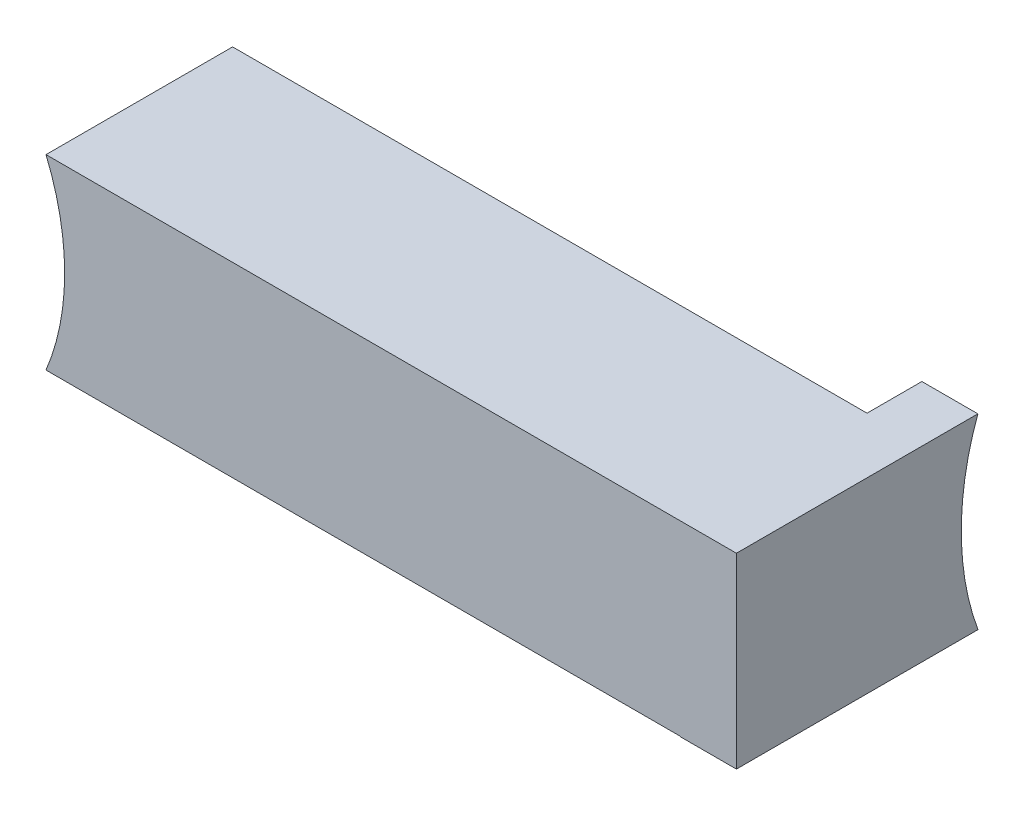
ISO-10303-21;
HEADER;
FILE_DESCRIPTION(('STEP AP214'),'2;1');
FILE_NAME('part.step','',(''),(''),'','','');
FILE_SCHEMA(('AUTOMOTIVE_DESIGN { 1 0 10303 214 1 1 1 1 }'));
ENDSEC;
DATA;
#1=APPLICATION_CONTEXT('core data for automotive mechanical design processes');
#2=APPLICATION_PROTOCOL_DEFINITION('international standard','automotive_design',2000,#1);
#3=PRODUCT_CONTEXT('',#1,'mechanical');
#4=PRODUCT('Part','Part','',(#3));
#5=PRODUCT_RELATED_PRODUCT_CATEGORY('part','',(#4));
#6=PRODUCT_DEFINITION_FORMATION('','',#4);
#7=PRODUCT_DEFINITION_CONTEXT('part definition',#1,'design');
#8=PRODUCT_DEFINITION('design','',#6,#7);
#9=PRODUCT_DEFINITION_SHAPE('','',#8);
#10=(LENGTH_UNIT() NAMED_UNIT(*) SI_UNIT(.MILLI.,.METRE.));
#11=(NAMED_UNIT(*) PLANE_ANGLE_UNIT() SI_UNIT($,.RADIAN.));
#12=(NAMED_UNIT(*) SI_UNIT($,.STERADIAN.) SOLID_ANGLE_UNIT());
#13=UNCERTAINTY_MEASURE_WITH_UNIT(LENGTH_MEASURE(1.E-05),#10,'distance_accuracy_value','');
#14=(GEOMETRIC_REPRESENTATION_CONTEXT(3) GLOBAL_UNCERTAINTY_ASSIGNED_CONTEXT((#13)) GLOBAL_UNIT_ASSIGNED_CONTEXT((#10,
#11,#12)) REPRESENTATION_CONTEXT('',''));
#15=CARTESIAN_POINT('',(0.,0.,0.));
#16=DIRECTION('',(0.,0.,1.));
#17=DIRECTION('',(1.,0.,0.));
#18=AXIS2_PLACEMENT_3D('',#15,#16,#17);
#19=CARTESIAN_POINT('',(-40.,5.,-5.));
#20=DIRECTION('',(0.,0.,-1.));
#21=DIRECTION('',(0.,1.,0.));
#22=AXIS2_PLACEMENT_3D('',#19,#20,#21);
#23=PLANE('',#22);
#24=CARTESIAN_POINT('',(-49.,0.,-5.));
#25=DIRECTION('',(0.,0.,-1.));
#26=DIRECTION('',(0.,1.,0.));
#27=AXIS2_PLACEMENT_3D('',#24,#25,#26);
#28=CIRCLE('',#27,13.);
#29=CARTESIAN_POINT('',(-37.,5.,-5.));
#30=VERTEX_POINT('',#29);
#31=CARTESIAN_POINT('',(-37.,-5.,-5.));
#32=VERTEX_POINT('',#31);
#33=EDGE_CURVE('E90',#30,#32,#28,.T.);
#34=ORIENTED_EDGE('',*,*,#33,.F.);
#35=DIRECTION('',(1.,0.,0.));
#36=VECTOR('',#35,1.);
#37=CARTESIAN_POINT('',(-40.,5.,-5.));
#38=LINE('',#37,#36);
#39=CARTESIAN_POINT('',(-3.,5.,-5.));
#40=VERTEX_POINT('',#39);
#41=EDGE_CURVE('E110',#30,#40,#38,.T.);
#42=ORIENTED_EDGE('',*,*,#41,.T.);
#43=DIRECTION('',(0.,-1.,0.));
#44=VECTOR('',#43,1.);
#45=CARTESIAN_POINT('',(-3.,5.,-5.));
#46=LINE('',#45,#44);
#47=CARTESIAN_POINT('',(-3.,-5.,-5.));
#48=VERTEX_POINT('',#47);
#49=EDGE_CURVE('E144',#40,#48,#46,.T.);
#50=ORIENTED_EDGE('',*,*,#49,.T.);
#51=DIRECTION('',(1.,0.,0.));
#52=VECTOR('',#51,1.);
#53=CARTESIAN_POINT('',(-40.,-5.,-5.));
#54=LINE('',#53,#52);
#55=EDGE_CURVE('E107',#32,#48,#54,.T.);
#56=ORIENTED_EDGE('',*,*,#55,.F.);
#57=EDGE_LOOP('',(#34,#42,#50,#56));
#58=FACE_BOUND('',#57,.T.);
#59=ADVANCED_FACE('F31',(#58),#23,.T.);
#60=CARTESIAN_POINT('',(-40.,-5.,5.));
#61=DIRECTION('',(0.,-1.,0.));
#62=DIRECTION('',(0.,0.,-1.));
#63=AXIS2_PLACEMENT_3D('',#60,#61,#62);
#64=PLANE('',#63);
#65=DIRECTION('',(0.,0.,1.));
#66=VECTOR('',#65,1.);
#67=CARTESIAN_POINT('',(-37.,-5.,-18.));
#68=LINE('',#67,#66);
#69=CARTESIAN_POINT('',(-37.,-5.,5.));
#70=VERTEX_POINT('',#69);
#71=EDGE_CURVE('E87',#32,#70,#68,.T.);
#72=ORIENTED_EDGE('',*,*,#71,.F.);
#73=ORIENTED_EDGE('',*,*,#55,.T.);
#74=DIRECTION('',(0.,0.,1.));
#75=VECTOR('',#74,1.);
#76=CARTESIAN_POINT('',(-3.,-5.,5.));
#77=LINE('',#76,#75);
#78=CARTESIAN_POINT('',(-3.,-4.99999999999999,5.));
#79=VERTEX_POINT('',#78);
#80=EDGE_CURVE('E106',#48,#79,#77,.T.);
#81=ORIENTED_EDGE('',*,*,#80,.T.);
#82=DIRECTION('',(1.,0.,0.));
#83=VECTOR('',#82,1.);
#84=CARTESIAN_POINT('',(-40.,-5.,5.));
#85=LINE('',#84,#83);
#86=EDGE_CURVE('E98',#70,#79,#85,.T.);
#87=ORIENTED_EDGE('',*,*,#86,.F.);
#88=EDGE_LOOP('',(#72,#73,#81,#87));
#89=FACE_BOUND('',#88,.T.);
#90=ADVANCED_FACE('F104',(#89),#64,.T.);
#91=CARTESIAN_POINT('',(-40.,5.,5.));
#92=DIRECTION('',(0.,0.,1.));
#93=DIRECTION('',(1.,0.,0.));
#94=AXIS2_PLACEMENT_3D('',#91,#92,#93);
#95=PLANE('',#94);
#96=CARTESIAN_POINT('',(-49.,0.,5.));
#97=DIRECTION('',(0.,0.,1.));
#98=DIRECTION('',(1.,0.,0.));
#99=AXIS2_PLACEMENT_3D('',#96,#97,#98);
#100=CIRCLE('',#99,13.);
#101=CARTESIAN_POINT('',(-37.,5.,5.));
#102=VERTEX_POINT('',#101);
#103=EDGE_CURVE('E45',#70,#102,#100,.T.);
#104=ORIENTED_EDGE('',*,*,#103,.F.);
#105=ORIENTED_EDGE('',*,*,#86,.T.);
#106=DIRECTION('',(0.,-1.,0.));
#107=VECTOR('',#106,1.);
#108=CARTESIAN_POINT('',(-3.,5.,5.));
#109=LINE('',#108,#107);
#110=CARTESIAN_POINT('',(-3.,-5.02020806625443,5.));
#111=VERTEX_POINT('',#110);
#112=EDGE_CURVE('E134',#79,#111,#109,.T.);
#113=ORIENTED_EDGE('',*,*,#112,.T.);
#114=DIRECTION('',(1.,0.,0.));
#115=VECTOR('',#114,1.);
#116=CARTESIAN_POINT('',(-3.,-5.02020806625443,5.));
#117=LINE('',#116,#115);
#118=CARTESIAN_POINT('',(0.,-5.02020806625443,5.));
#119=VERTEX_POINT('',#118);
#120=EDGE_CURVE('E133',#111,#119,#117,.T.);
#121=ORIENTED_EDGE('',*,*,#120,.T.);
#122=DIRECTION('',(0.,-1.,0.));
#123=VECTOR('',#122,1.);
#124=CARTESIAN_POINT('',(0.,5.,5.));
#125=LINE('',#124,#123);
#126=CARTESIAN_POINT('',(0.,5.,5.));
#127=VERTEX_POINT('',#126);
#128=EDGE_CURVE('E113',#127,#119,#125,.T.);
#129=ORIENTED_EDGE('',*,*,#128,.F.);
#130=DIRECTION('',(1.,0.,0.));
#131=VECTOR('',#130,1.);
#132=CARTESIAN_POINT('',(-40.,5.,5.));
#133=LINE('',#132,#131);
#134=EDGE_CURVE('E101',#102,#127,#133,.T.);
#135=ORIENTED_EDGE('',*,*,#134,.F.);
#136=EDGE_LOOP('',(#104,#105,#113,#121,#129,#135));
#137=FACE_BOUND('',#136,.T.);
#138=ADVANCED_FACE('F33',(#137),#95,.T.);
#139=CARTESIAN_POINT('',(-40.,5.,5.));
#140=DIRECTION('',(0.,1.,0.));
#141=DIRECTION('',(0.,0.,1.));
#142=AXIS2_PLACEMENT_3D('',#139,#140,#141);
#143=PLANE('',#142);
#144=DIRECTION('',(0.,0.,1.));
#145=VECTOR('',#144,1.);
#146=CARTESIAN_POINT('',(-37.,5.,-18.));
#147=LINE('',#146,#145);
#148=EDGE_CURVE('E11',#102,#30,#147,.F.);
#149=ORIENTED_EDGE('',*,*,#148,.F.);
#150=ORIENTED_EDGE('',*,*,#134,.T.);
#151=DIRECTION('',(0.,0.,1.));
#152=VECTOR('',#151,1.);
#153=CARTESIAN_POINT('',(0.,5.,5.));
#154=LINE('',#153,#152);
#155=CARTESIAN_POINT('',(0.,5.,-7.93934241118381));
#156=VERTEX_POINT('',#155);
#157=EDGE_CURVE('E108',#156,#127,#154,.T.);
#158=ORIENTED_EDGE('',*,*,#157,.F.);
#159=DIRECTION('',(1.,0.,0.));
#160=VECTOR('',#159,1.);
#161=CARTESIAN_POINT('',(-23.,5.,-7.93934241118381));
#162=LINE('',#161,#160);
#163=CARTESIAN_POINT('',(-3.,5.,-7.93934241118381));
#164=VERTEX_POINT('',#163);
#165=EDGE_CURVE('E142',#164,#156,#162,.T.);
#166=ORIENTED_EDGE('',*,*,#165,.F.);
#167=DIRECTION('',(0.,0.,1.));
#168=VECTOR('',#167,1.);
#169=CARTESIAN_POINT('',(-3.,5.,5.));
#170=LINE('',#169,#168);
#171=EDGE_CURVE('E125',#164,#40,#170,.T.);
#172=ORIENTED_EDGE('',*,*,#171,.T.);
#173=ORIENTED_EDGE('',*,*,#41,.F.);
#174=EDGE_LOOP('',(#149,#150,#158,#166,#172,#173));
#175=FACE_BOUND('',#174,.T.);
#176=ADVANCED_FACE('F151',(#175),#143,.T.);
#177=CARTESIAN_POINT('',(0.,5.,5.));
#178=DIRECTION('',(1.,0.,0.));
#179=DIRECTION('',(0.,0.,-1.));
#180=AXIS2_PLACEMENT_3D('',#177,#178,#179);
#181=PLANE('',#180);
#182=CARTESIAN_POINT('',(0.,0.,-21.55));
#183=DIRECTION('',(1.,0.,0.));
#184=DIRECTION('',(0.,0.,-1.));
#185=AXIS2_PLACEMENT_3D('',#182,#183,#184);
#186=CIRCLE('',#185,14.5);
#187=CARTESIAN_POINT('',(0.,-5.02020806625443,-7.94678306533658));
#188=VERTEX_POINT('',#187);
#189=EDGE_CURVE('E94',#156,#188,#186,.T.);
#190=ORIENTED_EDGE('',*,*,#189,.F.);
#191=ORIENTED_EDGE('',*,*,#157,.T.);
#192=ORIENTED_EDGE('',*,*,#128,.T.);
#193=DIRECTION('',(0.,0.,-1.));
#194=VECTOR('',#193,1.);
#195=CARTESIAN_POINT('',(0.,-5.02020806625443,5.));
#196=LINE('',#195,#194);
#197=EDGE_CURVE('E137',#119,#188,#196,.T.);
#198=ORIENTED_EDGE('',*,*,#197,.T.);
#199=EDGE_LOOP('',(#190,#191,#192,#198));
#200=FACE_BOUND('',#199,.T.);
#201=ADVANCED_FACE('F155',(#200),#181,.T.);
#202=CARTESIAN_POINT('',(-3.,-5.02020806625443,5.));
#203=DIRECTION('',(0.,-1.,0.));
#204=DIRECTION('',(0.,0.,-1.));
#205=AXIS2_PLACEMENT_3D('',#202,#203,#204);
#206=PLANE('',#205);
#207=DIRECTION('',(1.,0.,0.));
#208=VECTOR('',#207,1.);
#209=CARTESIAN_POINT('',(-23.,-5.02020806625443,-7.94678306533658));
#210=LINE('',#209,#208);
#211=CARTESIAN_POINT('',(-3.,-5.02020806625443,-7.94678306533658));
#212=VERTEX_POINT('',#211);
#213=EDGE_CURVE('E53',#188,#212,#210,.F.);
#214=ORIENTED_EDGE('',*,*,#213,.F.);
#215=ORIENTED_EDGE('',*,*,#197,.F.);
#216=ORIENTED_EDGE('',*,*,#120,.F.);
#217=DIRECTION('',(0.,0.,-1.));
#218=VECTOR('',#217,1.);
#219=CARTESIAN_POINT('',(-3.,-5.02020806625443,5.));
#220=LINE('',#219,#218);
#221=EDGE_CURVE('E122',#111,#212,#220,.T.);
#222=ORIENTED_EDGE('',*,*,#221,.T.);
#223=EDGE_LOOP('',(#214,#215,#216,#222));
#224=FACE_BOUND('',#223,.T.);
#225=ADVANCED_FACE('F129',(#224),#206,.T.);
#226=CARTESIAN_POINT('',(-3.,-5.02020806625443,5.));
#227=DIRECTION('',(1.,0.,0.));
#228=DIRECTION('',(0.,0.,-1.));
#229=AXIS2_PLACEMENT_3D('',#226,#227,#228);
#230=PLANE('',#229);
#231=ORIENTED_EDGE('',*,*,#171,.F.);
#232=CARTESIAN_POINT('',(-3.,0.,-21.55));
#233=DIRECTION('',(1.,0.,0.));
#234=DIRECTION('',(0.,0.,-1.));
#235=AXIS2_PLACEMENT_3D('',#232,#233,#234);
#236=CIRCLE('',#235,14.5);
#237=EDGE_CURVE('E39',#164,#212,#236,.T.);
#238=ORIENTED_EDGE('',*,*,#237,.T.);
#239=ORIENTED_EDGE('',*,*,#221,.F.);
#240=ORIENTED_EDGE('',*,*,#112,.F.);
#241=ORIENTED_EDGE('',*,*,#80,.F.);
#242=ORIENTED_EDGE('',*,*,#49,.F.);
#243=EDGE_LOOP('',(#231,#238,#239,#240,#241,#242));
#244=FACE_BOUND('',#243,.T.);
#245=ADVANCED_FACE('F121',(#244),#230,.F.);
#246=CARTESIAN_POINT('',(-23.,0.,-21.55));
#247=DIRECTION('',(1.,0.,0.));
#248=DIRECTION('',(0.,0.,-1.));
#249=AXIS2_PLACEMENT_3D('',#246,#247,#248);
#250=CYLINDRICAL_SURFACE('',#249,14.5);
#251=ORIENTED_EDGE('',*,*,#165,.T.);
#252=ORIENTED_EDGE('',*,*,#189,.T.);
#253=ORIENTED_EDGE('',*,*,#213,.T.);
#254=ORIENTED_EDGE('',*,*,#237,.F.);
#255=EDGE_LOOP('',(#251,#252,#253,#254));
#256=FACE_BOUND('',#255,.T.);
#257=ADVANCED_FACE('F159',(#256),#250,.F.);
#258=CARTESIAN_POINT('',(-49.,0.,-18.));
#259=DIRECTION('',(0.,0.,1.));
#260=DIRECTION('',(1.,0.,0.));
#261=AXIS2_PLACEMENT_3D('',#258,#259,#260);
#262=CYLINDRICAL_SURFACE('',#261,13.);
#263=ORIENTED_EDGE('',*,*,#71,.T.);
#264=ORIENTED_EDGE('',*,*,#103,.T.);
#265=ORIENTED_EDGE('',*,*,#148,.T.);
#266=ORIENTED_EDGE('',*,*,#33,.T.);
#267=EDGE_LOOP('',(#263,#264,#265,#266));
#268=FACE_BOUND('',#267,.T.);
#269=ADVANCED_FACE('F88',(#268),#262,.F.);
#270=CLOSED_SHELL('',(#59,#90,#138,#176,#201,#225,#245,#257,#269));
#271=MANIFOLD_SOLID_BREP('B2',#270);
#272=ADVANCED_BREP_SHAPE_REPRESENTATION('',(#18,#271),#14);
#273=SHAPE_DEFINITION_REPRESENTATION(#9,#272);
ENDSEC;
END-ISO-10303-21;
